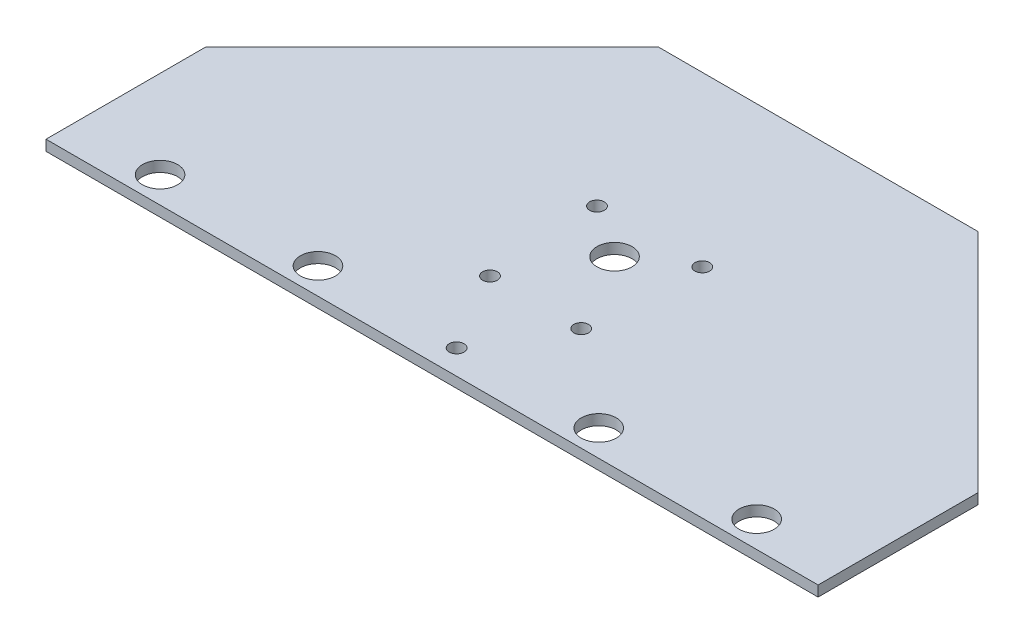
ISO-10303-21;
HEADER;
FILE_DESCRIPTION(('STEP AP214'),'2;1');
FILE_NAME('part.step','',(''),(''),'','','');
FILE_SCHEMA(('AUTOMOTIVE_DESIGN { 1 0 10303 214 1 1 1 1 }'));
ENDSEC;
DATA;
#1=APPLICATION_CONTEXT('core data for automotive mechanical design processes');
#2=APPLICATION_PROTOCOL_DEFINITION('international standard','automotive_design',2000,#1);
#3=PRODUCT_CONTEXT('',#1,'mechanical');
#4=PRODUCT('Part','Part','',(#3));
#5=PRODUCT_RELATED_PRODUCT_CATEGORY('part','',(#4));
#6=PRODUCT_DEFINITION_FORMATION('','',#4);
#7=PRODUCT_DEFINITION_CONTEXT('part definition',#1,'design');
#8=PRODUCT_DEFINITION('design','',#6,#7);
#9=PRODUCT_DEFINITION_SHAPE('','',#8);
#10=(LENGTH_UNIT() NAMED_UNIT(*) SI_UNIT(.MILLI.,.METRE.));
#11=(NAMED_UNIT(*) PLANE_ANGLE_UNIT() SI_UNIT($,.RADIAN.));
#12=(NAMED_UNIT(*) SI_UNIT($,.STERADIAN.) SOLID_ANGLE_UNIT());
#13=UNCERTAINTY_MEASURE_WITH_UNIT(LENGTH_MEASURE(1.E-05),#10,'distance_accuracy_value','');
#14=(GEOMETRIC_REPRESENTATION_CONTEXT(3) GLOBAL_UNCERTAINTY_ASSIGNED_CONTEXT((#13)) GLOBAL_UNIT_ASSIGNED_CONTEXT((#10,
#11,#12)) REPRESENTATION_CONTEXT('',''));
#15=CARTESIAN_POINT('',(0.,0.,0.));
#16=DIRECTION('',(0.,0.,1.));
#17=DIRECTION('',(1.,0.,0.));
#18=AXIS2_PLACEMENT_3D('',#15,#16,#17);
#19=CARTESIAN_POINT('',(110.,3.,-31.616111773091));
#20=DIRECTION('',(-1.,0.,0.));
#21=DIRECTION('',(0.,0.,1.));
#22=AXIS2_PLACEMENT_3D('',#19,#20,#21);
#23=PLANE('',#22);
#24=DIRECTION('',(0.,0.,-1.));
#25=VECTOR('',#24,1.);
#26=CARTESIAN_POINT('',(110.,0.,-31.616111773091));
#27=LINE('',#26,#25);
#28=CARTESIAN_POINT('',(110.,0.,13.9473800879495));
#29=VERTEX_POINT('',#28);
#30=CARTESIAN_POINT('',(110.,0.,-31.616111773091));
#31=VERTEX_POINT('',#30);
#32=EDGE_CURVE('E118',#29,#31,#27,.T.);
#33=ORIENTED_EDGE('',*,*,#32,.T.);
#34=DIRECTION('',(0.,-1.,0.));
#35=VECTOR('',#34,1.);
#36=CARTESIAN_POINT('',(110.,3.,-31.616111773091));
#37=LINE('',#36,#35);
#38=CARTESIAN_POINT('',(110.,3.,-31.616111773091));
#39=VERTEX_POINT('',#38);
#40=EDGE_CURVE('E11',#39,#31,#37,.T.);
#41=ORIENTED_EDGE('',*,*,#40,.F.);
#42=DIRECTION('',(0.,0.,-1.));
#43=VECTOR('',#42,1.);
#44=CARTESIAN_POINT('',(110.,3.,-31.616111773091));
#45=LINE('',#44,#43);
#46=CARTESIAN_POINT('',(110.,3.,13.9473800879495));
#47=VERTEX_POINT('',#46);
#48=EDGE_CURVE('E130',#47,#39,#45,.T.);
#49=ORIENTED_EDGE('',*,*,#48,.F.);
#50=DIRECTION('',(0.,-1.,0.));
#51=VECTOR('',#50,1.);
#52=CARTESIAN_POINT('',(110.,3.,13.9473800879495));
#53=LINE('',#52,#51);
#54=EDGE_CURVE('E114',#47,#29,#53,.T.);
#55=ORIENTED_EDGE('',*,*,#54,.T.);
#56=EDGE_LOOP('',(#33,#41,#49,#55));
#57=FACE_BOUND('',#56,.T.);
#58=ADVANCED_FACE('F34',(#57),#23,.F.);
#59=CARTESIAN_POINT('',(45.5634918610405,3.00000000000001,-96.0526199120505));
#60=DIRECTION('',(-0.707106781186548,0.,0.707106781186548));
#61=DIRECTION('',(0.707106781186548,0.,0.707106781186548));
#62=AXIS2_PLACEMENT_3D('',#59,#60,#61);
#63=PLANE('',#62);
#64=DIRECTION('',(-0.707106781186547,0.,-0.707106781186547));
#65=VECTOR('',#64,1.);
#66=CARTESIAN_POINT('',(45.5634918610405,0.,-96.0526199120505));
#67=LINE('',#66,#65);
#68=CARTESIAN_POINT('',(45.5634918610405,0.,-96.0526199120505));
#69=VERTEX_POINT('',#68);
#70=EDGE_CURVE('E121',#31,#69,#67,.T.);
#71=ORIENTED_EDGE('',*,*,#70,.T.);
#72=DIRECTION('',(0.,-1.,0.));
#73=VECTOR('',#72,1.);
#74=CARTESIAN_POINT('',(45.5634918610405,3.00000000000001,-96.0526199120505));
#75=LINE('',#74,#73);
#76=CARTESIAN_POINT('',(45.5634918610405,3.00000000000001,-96.0526199120505));
#77=VERTEX_POINT('',#76);
#78=EDGE_CURVE('E42',#77,#69,#75,.T.);
#79=ORIENTED_EDGE('',*,*,#78,.F.);
#80=DIRECTION('',(-0.707106781186547,0.,-0.707106781186547));
#81=VECTOR('',#80,1.);
#82=CARTESIAN_POINT('',(45.5634918610405,3.00000000000001,-96.0526199120505));
#83=LINE('',#82,#81);
#84=EDGE_CURVE('E87',#39,#77,#83,.T.);
#85=ORIENTED_EDGE('',*,*,#84,.F.);
#86=ORIENTED_EDGE('',*,*,#40,.T.);
#87=EDGE_LOOP('',(#71,#79,#85,#86));
#88=FACE_BOUND('',#87,.T.);
#89=ADVANCED_FACE('F136',(#88),#63,.F.);
#90=CARTESIAN_POINT('',(-45.5634918610405,3.00000000000001,-96.0526199120505));
#91=DIRECTION('',(0.,0.,1.));
#92=DIRECTION('',(0.,-1.,0.));
#93=AXIS2_PLACEMENT_3D('',#90,#91,#92);
#94=PLANE('',#93);
#95=DIRECTION('',(-1.,0.,0.));
#96=VECTOR('',#95,1.);
#97=CARTESIAN_POINT('',(-45.5634918610405,0.,-96.0526199120505));
#98=LINE('',#97,#96);
#99=CARTESIAN_POINT('',(-45.5634918610405,0.,-96.0526199120505));
#100=VERTEX_POINT('',#99);
#101=EDGE_CURVE('E125',#69,#100,#98,.T.);
#102=ORIENTED_EDGE('',*,*,#101,.T.);
#103=DIRECTION('',(0.,-1.,0.));
#104=VECTOR('',#103,1.);
#105=CARTESIAN_POINT('',(-45.5634918610405,3.00000000000001,-96.0526199120505));
#106=LINE('',#105,#104);
#107=CARTESIAN_POINT('',(-45.5634918610405,3.00000000000001,-96.0526199120505));
#108=VERTEX_POINT('',#107);
#109=EDGE_CURVE('E109',#108,#100,#106,.T.);
#110=ORIENTED_EDGE('',*,*,#109,.F.);
#111=DIRECTION('',(-1.,0.,0.));
#112=VECTOR('',#111,1.);
#113=CARTESIAN_POINT('',(0.,3.00000000000001,-96.0526199120505));
#114=LINE('',#113,#112);
#115=EDGE_CURVE('E100',#77,#108,#114,.T.);
#116=ORIENTED_EDGE('',*,*,#115,.F.);
#117=ORIENTED_EDGE('',*,*,#78,.T.);
#118=EDGE_LOOP('',(#102,#110,#116,#117));
#119=FACE_BOUND('',#118,.T.);
#120=ADVANCED_FACE('F135',(#119),#94,.F.);
#121=CARTESIAN_POINT('',(-110.,3.,-31.616111773091));
#122=DIRECTION('',(0.707106781186548,0.,0.707106781186548));
#123=DIRECTION('',(0.707106781186548,0.,-0.707106781186548));
#124=AXIS2_PLACEMENT_3D('',#121,#122,#123);
#125=PLANE('',#124);
#126=DIRECTION('',(-0.707106781186547,0.,0.707106781186547));
#127=VECTOR('',#126,1.);
#128=CARTESIAN_POINT('',(-110.,0.,-31.616111773091));
#129=LINE('',#128,#127);
#130=CARTESIAN_POINT('',(-110.,0.,-31.616111773091));
#131=VERTEX_POINT('',#130);
#132=EDGE_CURVE('E108',#100,#131,#129,.T.);
#133=ORIENTED_EDGE('',*,*,#132,.T.);
#134=DIRECTION('',(0.,-1.,0.));
#135=VECTOR('',#134,1.);
#136=CARTESIAN_POINT('',(-110.,3.,-31.616111773091));
#137=LINE('',#136,#135);
#138=CARTESIAN_POINT('',(-110.,3.,-31.616111773091));
#139=VERTEX_POINT('',#138);
#140=EDGE_CURVE('E105',#139,#131,#137,.T.);
#141=ORIENTED_EDGE('',*,*,#140,.F.);
#142=DIRECTION('',(-0.707106781186547,0.,0.707106781186547));
#143=VECTOR('',#142,1.);
#144=CARTESIAN_POINT('',(-110.,3.,-31.616111773091));
#145=LINE('',#144,#143);
#146=EDGE_CURVE('E94',#108,#139,#145,.T.);
#147=ORIENTED_EDGE('',*,*,#146,.F.);
#148=ORIENTED_EDGE('',*,*,#109,.T.);
#149=EDGE_LOOP('',(#133,#141,#147,#148));
#150=FACE_BOUND('',#149,.T.);
#151=ADVANCED_FACE('F106',(#150),#125,.F.);
#152=CARTESIAN_POINT('',(-110.,3.,13.9473800879495));
#153=DIRECTION('',(1.,0.,0.));
#154=DIRECTION('',(0.,0.,-1.));
#155=AXIS2_PLACEMENT_3D('',#152,#153,#154);
#156=PLANE('',#155);
#157=DIRECTION('',(0.,0.,1.));
#158=VECTOR('',#157,1.);
#159=CARTESIAN_POINT('',(-110.,0.,13.9473800879495));
#160=LINE('',#159,#158);
#161=CARTESIAN_POINT('',(-110.,0.,13.9473800879495));
#162=VERTEX_POINT('',#161);
#163=EDGE_CURVE('E73',#131,#162,#160,.T.);
#164=ORIENTED_EDGE('',*,*,#163,.T.);
#165=DIRECTION('',(0.,-1.,0.));
#166=VECTOR('',#165,1.);
#167=CARTESIAN_POINT('',(-110.,3.,13.9473800879495));
#168=LINE('',#167,#166);
#169=CARTESIAN_POINT('',(-110.,3.,13.9473800879495));
#170=VERTEX_POINT('',#169);
#171=EDGE_CURVE('E110',#170,#162,#168,.T.);
#172=ORIENTED_EDGE('',*,*,#171,.F.);
#173=DIRECTION('',(0.,0.,1.));
#174=VECTOR('',#173,1.);
#175=CARTESIAN_POINT('',(-110.,3.,13.9473800879495));
#176=LINE('',#175,#174);
#177=EDGE_CURVE('E98',#139,#170,#176,.T.);
#178=ORIENTED_EDGE('',*,*,#177,.F.);
#179=ORIENTED_EDGE('',*,*,#140,.T.);
#180=EDGE_LOOP('',(#164,#172,#178,#179));
#181=FACE_BOUND('',#180,.T.);
#182=ADVANCED_FACE('F112',(#181),#156,.F.);
#183=CARTESIAN_POINT('',(-110.,3.,13.9473800879495));
#184=DIRECTION('',(0.,0.,-1.));
#185=DIRECTION('',(-1.,0.,0.));
#186=AXIS2_PLACEMENT_3D('',#183,#184,#185);
#187=PLANE('',#186);
#188=DIRECTION('',(1.,0.,0.));
#189=VECTOR('',#188,1.);
#190=CARTESIAN_POINT('',(-110.,0.,13.9473800879495));
#191=LINE('',#190,#189);
#192=EDGE_CURVE('E79',#162,#29,#191,.T.);
#193=ORIENTED_EDGE('',*,*,#192,.T.);
#194=ORIENTED_EDGE('',*,*,#54,.F.);
#195=DIRECTION('',(1.,0.,0.));
#196=VECTOR('',#195,1.);
#197=CARTESIAN_POINT('',(-110.,3.,13.9473800879495));
#198=LINE('',#197,#196);
#199=EDGE_CURVE('E50',#170,#47,#198,.T.);
#200=ORIENTED_EDGE('',*,*,#199,.F.);
#201=ORIENTED_EDGE('',*,*,#171,.T.);
#202=EDGE_LOOP('',(#193,#194,#200,#201));
#203=FACE_BOUND('',#202,.T.);
#204=ADVANCED_FACE('F143',(#203),#187,.F.);
#205=CARTESIAN_POINT('',(110.,3.00000000000001,-96.0526199120505));
#206=DIRECTION('',(0.,1.,0.));
#207=DIRECTION('',(0.,0.,1.));
#208=AXIS2_PLACEMENT_3D('',#205,#206,#207);
#209=PLANE('',#208);
#210=CARTESIAN_POINT('',(0.,2.9999999999859,6.94738008794952));
#211=DIRECTION('',(0.,1.,0.));
#212=DIRECTION('',(0.,0.,1.));
#213=AXIS2_PLACEMENT_3D('',#210,#211,#212);
#214=CIRCLE('',#213,2.10000000000018);
#215=CARTESIAN_POINT('',(0.,2.9999999999859,9.04738008794969));
#216=VERTEX_POINT('',#215);
#217=EDGE_CURVE('E301',#216,#216,#214,.T.);
#218=ORIENTED_EDGE('',*,*,#217,.F.);
#219=EDGE_LOOP('',(#218));
#220=FACE_BOUND('',#219,.T.);
#221=CARTESIAN_POINT('',(-12.9899999999999,2.9999999999859,-15.5526199120504));
#222=DIRECTION('',(0.,1.,0.));
#223=DIRECTION('',(0.,0.,1.));
#224=AXIS2_PLACEMENT_3D('',#221,#222,#223);
#225=CIRCLE('',#224,2.10000000000028);
#226=CARTESIAN_POINT('',(-12.9899999999999,2.9999999999859,-13.4526199120501));
#227=VERTEX_POINT('',#226);
#228=EDGE_CURVE('E303',#227,#227,#225,.T.);
#229=ORIENTED_EDGE('',*,*,#228,.F.);
#230=EDGE_LOOP('',(#229));
#231=FACE_BOUND('',#230,.T.);
#232=CARTESIAN_POINT('',(12.9900000000001,2.9999999999859,-15.5526199120503));
#233=DIRECTION('',(0.,1.,0.));
#234=DIRECTION('',(0.,0.,1.));
#235=AXIS2_PLACEMENT_3D('',#232,#233,#234);
#236=CIRCLE('',#235,2.10000000000026);
#237=CARTESIAN_POINT('',(12.9900000000001,2.9999999999859,-13.4526199120501));
#238=VERTEX_POINT('',#237);
#239=EDGE_CURVE('E309',#238,#238,#236,.T.);
#240=ORIENTED_EDGE('',*,*,#239,.F.);
#241=EDGE_LOOP('',(#240));
#242=FACE_BOUND('',#241,.T.);
#243=CARTESIAN_POINT('',(15.0000000000002,2.9999999999859,-48.0526199120504));
#244=DIRECTION('',(0.,1.,0.));
#245=DIRECTION('',(0.,0.,1.));
#246=AXIS2_PLACEMENT_3D('',#243,#244,#245);
#247=CIRCLE('',#246,2.10000000000015);
#248=CARTESIAN_POINT('',(15.0000000000002,2.9999999999859,-45.9526199120503));
#249=VERTEX_POINT('',#248);
#250=EDGE_CURVE('E315',#249,#249,#247,.T.);
#251=ORIENTED_EDGE('',*,*,#250,.F.);
#252=EDGE_LOOP('',(#251));
#253=FACE_BOUND('',#252,.T.);
#254=CARTESIAN_POINT('',(-14.9999999999998,2.9999999999859,-48.0526199120505));
#255=DIRECTION('',(0.,1.,0.));
#256=DIRECTION('',(0.,0.,1.));
#257=AXIS2_PLACEMENT_3D('',#254,#255,#256);
#258=CIRCLE('',#257,2.10000000000019);
#259=CARTESIAN_POINT('',(-14.9999999999998,2.9999999999859,-45.9526199120503));
#260=VERTEX_POINT('',#259);
#261=EDGE_CURVE('E321',#260,#260,#258,.T.);
#262=ORIENTED_EDGE('',*,*,#261,.F.);
#263=EDGE_LOOP('',(#262));
#264=FACE_BOUND('',#263,.T.);
#265=CARTESIAN_POINT('',(0.,3.,-38.0526199120505));
#266=DIRECTION('',(0.,1.,0.));
#267=DIRECTION('',(0.,0.,1.));
#268=AXIS2_PLACEMENT_3D('',#265,#266,#267);
#269=CIRCLE('',#268,5.);
#270=CARTESIAN_POINT('',(0.,3.,-33.0526199120505));
#271=VERTEX_POINT('',#270);
#272=EDGE_CURVE('E327',#271,#271,#269,.T.);
#273=ORIENTED_EDGE('',*,*,#272,.F.);
#274=EDGE_LOOP('',(#273));
#275=FACE_BOUND('',#274,.T.);
#276=CARTESIAN_POINT('',(85.,3.,6.44738008794951));
#277=DIRECTION('',(0.,1.,0.));
#278=DIRECTION('',(0.,0.,1.));
#279=AXIS2_PLACEMENT_3D('',#276,#277,#278);
#280=CIRCLE('',#279,5.);
#281=CARTESIAN_POINT('',(85.,3.,11.4473800879495));
#282=VERTEX_POINT('',#281);
#283=EDGE_CURVE('E333',#282,#282,#280,.T.);
#284=ORIENTED_EDGE('',*,*,#283,.F.);
#285=EDGE_LOOP('',(#284));
#286=FACE_BOUND('',#285,.T.);
#287=CARTESIAN_POINT('',(40.,3.,6.44738008794952));
#288=DIRECTION('',(0.,1.,0.));
#289=DIRECTION('',(0.,0.,1.));
#290=AXIS2_PLACEMENT_3D('',#287,#288,#289);
#291=CIRCLE('',#290,5.);
#292=CARTESIAN_POINT('',(40.,3.,11.4473800879495));
#293=VERTEX_POINT('',#292);
#294=EDGE_CURVE('E339',#293,#293,#291,.T.);
#295=ORIENTED_EDGE('',*,*,#294,.F.);
#296=EDGE_LOOP('',(#295));
#297=FACE_BOUND('',#296,.T.);
#298=CARTESIAN_POINT('',(-40.,3.,6.44738008794953));
#299=DIRECTION('',(0.,1.,0.));
#300=DIRECTION('',(0.,0.,1.));
#301=AXIS2_PLACEMENT_3D('',#298,#299,#300);
#302=CIRCLE('',#301,5.);
#303=CARTESIAN_POINT('',(-40.,3.,11.4473800879495));
#304=VERTEX_POINT('',#303);
#305=EDGE_CURVE('E345',#304,#304,#302,.T.);
#306=ORIENTED_EDGE('',*,*,#305,.F.);
#307=EDGE_LOOP('',(#306));
#308=FACE_BOUND('',#307,.T.);
#309=CARTESIAN_POINT('',(-85.,3.,6.44738008794953));
#310=DIRECTION('',(0.,1.,0.));
#311=DIRECTION('',(0.,0.,1.));
#312=AXIS2_PLACEMENT_3D('',#309,#310,#311);
#313=CIRCLE('',#312,5.);
#314=CARTESIAN_POINT('',(-85.,3.,11.4473800879495));
#315=VERTEX_POINT('',#314);
#316=EDGE_CURVE('E351',#315,#315,#313,.T.);
#317=ORIENTED_EDGE('',*,*,#316,.F.);
#318=EDGE_LOOP('',(#317));
#319=FACE_BOUND('',#318,.T.);
#320=ORIENTED_EDGE('',*,*,#48,.T.);
#321=ORIENTED_EDGE('',*,*,#84,.T.);
#322=ORIENTED_EDGE('',*,*,#115,.T.);
#323=ORIENTED_EDGE('',*,*,#146,.T.);
#324=ORIENTED_EDGE('',*,*,#177,.T.);
#325=ORIENTED_EDGE('',*,*,#199,.T.);
#326=EDGE_LOOP('',(#320,#321,#322,#323,#324,#325));
#327=FACE_BOUND('',#326,.T.);
#328=ADVANCED_FACE('F96',(#220,#231,#242,#253,#264,#275,#286,#297,#308,#319,#327),#209,.T.);
#329=CARTESIAN_POINT('',(110.,0.,-96.0526199120505));
#330=DIRECTION('',(0.,1.,0.));
#331=DIRECTION('',(0.,0.,1.));
#332=AXIS2_PLACEMENT_3D('',#329,#330,#331);
#333=PLANE('',#332);
#334=CARTESIAN_POINT('',(0.,0.,6.94738008794952));
#335=DIRECTION('',(0.,1.,0.));
#336=DIRECTION('',(0.,0.,1.));
#337=AXIS2_PLACEMENT_3D('',#334,#335,#336);
#338=CIRCLE('',#337,2.10000000000018);
#339=CARTESIAN_POINT('',(0.,0.,9.04738008794969));
#340=VERTEX_POINT('',#339);
#341=EDGE_CURVE('E298',#340,#340,#338,.T.);
#342=ORIENTED_EDGE('',*,*,#341,.T.);
#343=EDGE_LOOP('',(#342));
#344=FACE_BOUND('',#343,.T.);
#345=CARTESIAN_POINT('',(-12.9899999999999,0.,-15.5526199120504));
#346=DIRECTION('',(0.,1.,0.));
#347=DIRECTION('',(0.,0.,1.));
#348=AXIS2_PLACEMENT_3D('',#345,#346,#347);
#349=CIRCLE('',#348,2.10000000000028);
#350=CARTESIAN_POINT('',(-12.9899999999999,0.,-13.4526199120501));
#351=VERTEX_POINT('',#350);
#352=EDGE_CURVE('E306',#351,#351,#349,.T.);
#353=ORIENTED_EDGE('',*,*,#352,.T.);
#354=EDGE_LOOP('',(#353));
#355=FACE_BOUND('',#354,.T.);
#356=CARTESIAN_POINT('',(12.9900000000001,0.,-15.5526199120503));
#357=DIRECTION('',(0.,1.,0.));
#358=DIRECTION('',(0.,0.,1.));
#359=AXIS2_PLACEMENT_3D('',#356,#357,#358);
#360=CIRCLE('',#359,2.10000000000026);
#361=CARTESIAN_POINT('',(12.9900000000001,0.,-13.4526199120501));
#362=VERTEX_POINT('',#361);
#363=EDGE_CURVE('E312',#362,#362,#360,.T.);
#364=ORIENTED_EDGE('',*,*,#363,.T.);
#365=EDGE_LOOP('',(#364));
#366=FACE_BOUND('',#365,.T.);
#367=CARTESIAN_POINT('',(15.0000000000002,0.,-48.0526199120504));
#368=DIRECTION('',(0.,1.,0.));
#369=DIRECTION('',(0.,0.,1.));
#370=AXIS2_PLACEMENT_3D('',#367,#368,#369);
#371=CIRCLE('',#370,2.10000000000015);
#372=CARTESIAN_POINT('',(15.0000000000002,0.,-45.9526199120503));
#373=VERTEX_POINT('',#372);
#374=EDGE_CURVE('E318',#373,#373,#371,.T.);
#375=ORIENTED_EDGE('',*,*,#374,.T.);
#376=EDGE_LOOP('',(#375));
#377=FACE_BOUND('',#376,.T.);
#378=CARTESIAN_POINT('',(-14.9999999999998,0.,-48.0526199120505));
#379=DIRECTION('',(0.,1.,0.));
#380=DIRECTION('',(0.,0.,1.));
#381=AXIS2_PLACEMENT_3D('',#378,#379,#380);
#382=CIRCLE('',#381,2.10000000000019);
#383=CARTESIAN_POINT('',(-14.9999999999998,0.,-45.9526199120503));
#384=VERTEX_POINT('',#383);
#385=EDGE_CURVE('E324',#384,#384,#382,.T.);
#386=ORIENTED_EDGE('',*,*,#385,.T.);
#387=EDGE_LOOP('',(#386));
#388=FACE_BOUND('',#387,.T.);
#389=CARTESIAN_POINT('',(0.,0.,-38.0526199120505));
#390=DIRECTION('',(0.,1.,0.));
#391=DIRECTION('',(0.,0.,1.));
#392=AXIS2_PLACEMENT_3D('',#389,#390,#391);
#393=CIRCLE('',#392,5.);
#394=CARTESIAN_POINT('',(0.,0.,-33.0526199120505));
#395=VERTEX_POINT('',#394);
#396=EDGE_CURVE('E330',#395,#395,#393,.T.);
#397=ORIENTED_EDGE('',*,*,#396,.T.);
#398=EDGE_LOOP('',(#397));
#399=FACE_BOUND('',#398,.T.);
#400=CARTESIAN_POINT('',(85.,0.,6.44738008794951));
#401=DIRECTION('',(0.,1.,0.));
#402=DIRECTION('',(0.,0.,1.));
#403=AXIS2_PLACEMENT_3D('',#400,#401,#402);
#404=CIRCLE('',#403,5.);
#405=CARTESIAN_POINT('',(85.,0.,11.4473800879495));
#406=VERTEX_POINT('',#405);
#407=EDGE_CURVE('E336',#406,#406,#404,.T.);
#408=ORIENTED_EDGE('',*,*,#407,.T.);
#409=EDGE_LOOP('',(#408));
#410=FACE_BOUND('',#409,.T.);
#411=CARTESIAN_POINT('',(40.,0.,6.44738008794952));
#412=DIRECTION('',(0.,1.,0.));
#413=DIRECTION('',(0.,0.,1.));
#414=AXIS2_PLACEMENT_3D('',#411,#412,#413);
#415=CIRCLE('',#414,5.);
#416=CARTESIAN_POINT('',(40.,0.,11.4473800879495));
#417=VERTEX_POINT('',#416);
#418=EDGE_CURVE('E342',#417,#417,#415,.T.);
#419=ORIENTED_EDGE('',*,*,#418,.T.);
#420=EDGE_LOOP('',(#419));
#421=FACE_BOUND('',#420,.T.);
#422=CARTESIAN_POINT('',(-40.,0.,6.44738008794953));
#423=DIRECTION('',(0.,1.,0.));
#424=DIRECTION('',(0.,0.,1.));
#425=AXIS2_PLACEMENT_3D('',#422,#423,#424);
#426=CIRCLE('',#425,5.);
#427=CARTESIAN_POINT('',(-40.,0.,11.4473800879495));
#428=VERTEX_POINT('',#427);
#429=EDGE_CURVE('E348',#428,#428,#426,.T.);
#430=ORIENTED_EDGE('',*,*,#429,.T.);
#431=EDGE_LOOP('',(#430));
#432=FACE_BOUND('',#431,.T.);
#433=CARTESIAN_POINT('',(-85.,0.,6.44738008794953));
#434=DIRECTION('',(0.,1.,0.));
#435=DIRECTION('',(0.,0.,1.));
#436=AXIS2_PLACEMENT_3D('',#433,#434,#435);
#437=CIRCLE('',#436,5.);
#438=CARTESIAN_POINT('',(-85.,0.,11.4473800879495));
#439=VERTEX_POINT('',#438);
#440=EDGE_CURVE('E122',#439,#439,#437,.T.);
#441=ORIENTED_EDGE('',*,*,#440,.T.);
#442=EDGE_LOOP('',(#441));
#443=FACE_BOUND('',#442,.T.);
#444=ORIENTED_EDGE('',*,*,#32,.F.);
#445=ORIENTED_EDGE('',*,*,#192,.F.);
#446=ORIENTED_EDGE('',*,*,#163,.F.);
#447=ORIENTED_EDGE('',*,*,#132,.F.);
#448=ORIENTED_EDGE('',*,*,#101,.F.);
#449=ORIENTED_EDGE('',*,*,#70,.F.);
#450=EDGE_LOOP('',(#444,#445,#446,#447,#448,#449));
#451=FACE_BOUND('',#450,.T.);
#452=ADVANCED_FACE('F140',(#344,#355,#366,#377,#388,#399,#410,#421,#432,#443,#451),#333,.F.);
#453=CARTESIAN_POINT('',(-85.,0.,6.44738008794953));
#454=DIRECTION('',(0.,1.,0.));
#455=DIRECTION('',(0.,0.,1.));
#456=AXIS2_PLACEMENT_3D('',#453,#454,#455);
#457=CYLINDRICAL_SURFACE('',#456,5.);
#458=ORIENTED_EDGE('',*,*,#440,.F.);
#459=EDGE_LOOP('',(#458));
#460=FACE_BOUND('',#459,.T.);
#461=ORIENTED_EDGE('',*,*,#316,.T.);
#462=EDGE_LOOP('',(#461));
#463=FACE_BOUND('',#462,.T.);
#464=ADVANCED_FACE('F182',(#460,#463),#457,.F.);
#465=CARTESIAN_POINT('',(-40.,0.,6.44738008794953));
#466=DIRECTION('',(0.,1.,0.));
#467=DIRECTION('',(0.,0.,1.));
#468=AXIS2_PLACEMENT_3D('',#465,#466,#467);
#469=CYLINDRICAL_SURFACE('',#468,5.);
#470=ORIENTED_EDGE('',*,*,#429,.F.);
#471=EDGE_LOOP('',(#470));
#472=FACE_BOUND('',#471,.T.);
#473=ORIENTED_EDGE('',*,*,#305,.T.);
#474=EDGE_LOOP('',(#473));
#475=FACE_BOUND('',#474,.T.);
#476=ADVANCED_FACE('F187',(#472,#475),#469,.F.);
#477=CARTESIAN_POINT('',(40.,0.,6.44738008794952));
#478=DIRECTION('',(0.,1.,0.));
#479=DIRECTION('',(0.,0.,1.));
#480=AXIS2_PLACEMENT_3D('',#477,#478,#479);
#481=CYLINDRICAL_SURFACE('',#480,5.);
#482=ORIENTED_EDGE('',*,*,#418,.F.);
#483=EDGE_LOOP('',(#482));
#484=FACE_BOUND('',#483,.T.);
#485=ORIENTED_EDGE('',*,*,#294,.T.);
#486=EDGE_LOOP('',(#485));
#487=FACE_BOUND('',#486,.T.);
#488=ADVANCED_FACE('F199',(#484,#487),#481,.F.);
#489=CARTESIAN_POINT('',(85.,0.,6.44738008794951));
#490=DIRECTION('',(0.,1.,0.));
#491=DIRECTION('',(0.,0.,1.));
#492=AXIS2_PLACEMENT_3D('',#489,#490,#491);
#493=CYLINDRICAL_SURFACE('',#492,5.);
#494=ORIENTED_EDGE('',*,*,#407,.F.);
#495=EDGE_LOOP('',(#494));
#496=FACE_BOUND('',#495,.T.);
#497=ORIENTED_EDGE('',*,*,#283,.T.);
#498=EDGE_LOOP('',(#497));
#499=FACE_BOUND('',#498,.T.);
#500=ADVANCED_FACE('F209',(#496,#499),#493,.F.);
#501=CARTESIAN_POINT('',(0.,0.,-38.0526199120505));
#502=DIRECTION('',(0.,1.,0.));
#503=DIRECTION('',(0.,0.,1.));
#504=AXIS2_PLACEMENT_3D('',#501,#502,#503);
#505=CYLINDRICAL_SURFACE('',#504,5.);
#506=ORIENTED_EDGE('',*,*,#396,.F.);
#507=EDGE_LOOP('',(#506));
#508=FACE_BOUND('',#507,.T.);
#509=ORIENTED_EDGE('',*,*,#272,.T.);
#510=EDGE_LOOP('',(#509));
#511=FACE_BOUND('',#510,.T.);
#512=ADVANCED_FACE('F219',(#508,#511),#505,.F.);
#513=CARTESIAN_POINT('',(-14.9999999999998,0.,-48.0526199120505));
#514=DIRECTION('',(0.,1.,0.));
#515=DIRECTION('',(0.,0.,1.));
#516=AXIS2_PLACEMENT_3D('',#513,#514,#515);
#517=CYLINDRICAL_SURFACE('',#516,2.10000000000019);
#518=ORIENTED_EDGE('',*,*,#385,.F.);
#519=EDGE_LOOP('',(#518));
#520=FACE_BOUND('',#519,.T.);
#521=ORIENTED_EDGE('',*,*,#261,.T.);
#522=EDGE_LOOP('',(#521));
#523=FACE_BOUND('',#522,.T.);
#524=ADVANCED_FACE('F229',(#520,#523),#517,.F.);
#525=CARTESIAN_POINT('',(15.0000000000002,0.,-48.0526199120504));
#526=DIRECTION('',(0.,1.,0.));
#527=DIRECTION('',(0.,0.,1.));
#528=AXIS2_PLACEMENT_3D('',#525,#526,#527);
#529=CYLINDRICAL_SURFACE('',#528,2.10000000000015);
#530=ORIENTED_EDGE('',*,*,#374,.F.);
#531=EDGE_LOOP('',(#530));
#532=FACE_BOUND('',#531,.T.);
#533=ORIENTED_EDGE('',*,*,#250,.T.);
#534=EDGE_LOOP('',(#533));
#535=FACE_BOUND('',#534,.T.);
#536=ADVANCED_FACE('F251',(#532,#535),#529,.F.);
#537=CARTESIAN_POINT('',(12.9900000000001,0.,-15.5526199120503));
#538=DIRECTION('',(0.,1.,0.));
#539=DIRECTION('',(0.,0.,1.));
#540=AXIS2_PLACEMENT_3D('',#537,#538,#539);
#541=CYLINDRICAL_SURFACE('',#540,2.10000000000026);
#542=ORIENTED_EDGE('',*,*,#363,.F.);
#543=EDGE_LOOP('',(#542));
#544=FACE_BOUND('',#543,.T.);
#545=ORIENTED_EDGE('',*,*,#239,.T.);
#546=EDGE_LOOP('',(#545));
#547=FACE_BOUND('',#546,.T.);
#548=ADVANCED_FACE('F261',(#544,#547),#541,.F.);
#549=CARTESIAN_POINT('',(-12.9899999999999,0.,-15.5526199120504));
#550=DIRECTION('',(0.,1.,0.));
#551=DIRECTION('',(0.,0.,1.));
#552=AXIS2_PLACEMENT_3D('',#549,#550,#551);
#553=CYLINDRICAL_SURFACE('',#552,2.10000000000028);
#554=ORIENTED_EDGE('',*,*,#352,.F.);
#555=EDGE_LOOP('',(#554));
#556=FACE_BOUND('',#555,.T.);
#557=ORIENTED_EDGE('',*,*,#228,.T.);
#558=EDGE_LOOP('',(#557));
#559=FACE_BOUND('',#558,.T.);
#560=ADVANCED_FACE('F271',(#556,#559),#553,.F.);
#561=CARTESIAN_POINT('',(0.,0.,6.94738008794952));
#562=DIRECTION('',(0.,1.,0.));
#563=DIRECTION('',(0.,0.,1.));
#564=AXIS2_PLACEMENT_3D('',#561,#562,#563);
#565=CYLINDRICAL_SURFACE('',#564,2.10000000000018);
#566=ORIENTED_EDGE('',*,*,#341,.F.);
#567=EDGE_LOOP('',(#566));
#568=FACE_BOUND('',#567,.T.);
#569=ORIENTED_EDGE('',*,*,#217,.T.);
#570=EDGE_LOOP('',(#569));
#571=FACE_BOUND('',#570,.T.);
#572=ADVANCED_FACE('F281',(#568,#571),#565,.F.);
#573=CLOSED_SHELL('',(#58,#89,#120,#151,#182,#204,#328,#452,#464,#476,#488,#500,#512,#524,#536,
#548,#560,#572));
#574=MANIFOLD_SOLID_BREP('B2',#573);
#575=ADVANCED_BREP_SHAPE_REPRESENTATION('',(#18,#574),#14);
#576=SHAPE_DEFINITION_REPRESENTATION(#9,#575);
ENDSEC;
END-ISO-10303-21;
